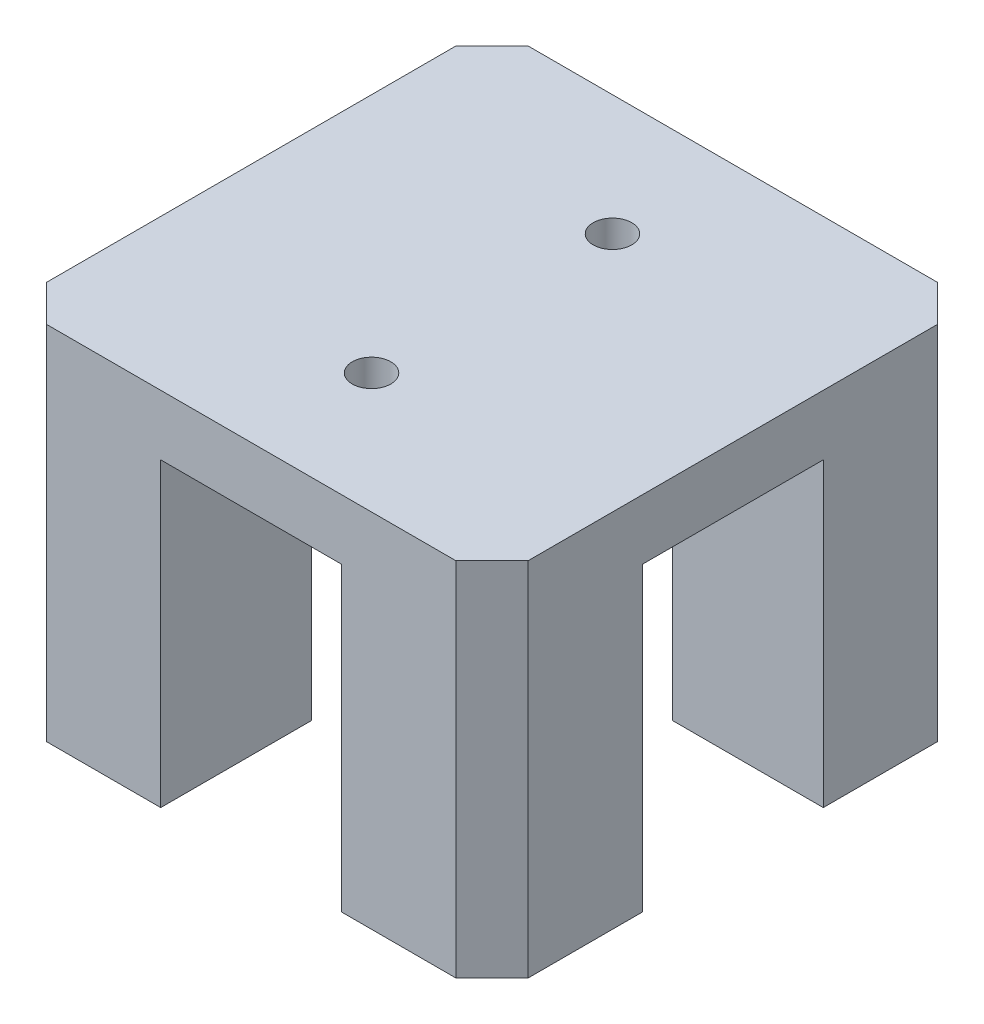
ISO-10303-21;
HEADER;
FILE_DESCRIPTION(('STEP AP214'),'2;1');
FILE_NAME('part.step','',(''),(''),'','','');
FILE_SCHEMA(('AUTOMOTIVE_DESIGN { 1 0 10303 214 1 1 1 1 }'));
ENDSEC;
DATA;
#1=APPLICATION_CONTEXT('core data for automotive mechanical design processes');
#2=APPLICATION_PROTOCOL_DEFINITION('international standard','automotive_design',2000,#1);
#3=PRODUCT_CONTEXT('',#1,'mechanical');
#4=PRODUCT('Part','Part','',(#3));
#5=PRODUCT_RELATED_PRODUCT_CATEGORY('part','',(#4));
#6=PRODUCT_DEFINITION_FORMATION('','',#4);
#7=PRODUCT_DEFINITION_CONTEXT('part definition',#1,'design');
#8=PRODUCT_DEFINITION('design','',#6,#7);
#9=PRODUCT_DEFINITION_SHAPE('','',#8);
#10=(LENGTH_UNIT() NAMED_UNIT(*) SI_UNIT(.MILLI.,.METRE.));
#11=(NAMED_UNIT(*) PLANE_ANGLE_UNIT() SI_UNIT($,.RADIAN.));
#12=(NAMED_UNIT(*) SI_UNIT($,.STERADIAN.) SOLID_ANGLE_UNIT());
#13=UNCERTAINTY_MEASURE_WITH_UNIT(LENGTH_MEASURE(1.E-05),#10,'distance_accuracy_value','');
#14=(GEOMETRIC_REPRESENTATION_CONTEXT(3) GLOBAL_UNCERTAINTY_ASSIGNED_CONTEXT((#13)) GLOBAL_UNIT_ASSIGNED_CONTEXT((#10,
#11,#12)) REPRESENTATION_CONTEXT('',''));
#15=CARTESIAN_POINT('',(0.,0.,0.));
#16=DIRECTION('',(0.,0.,1.));
#17=DIRECTION('',(1.,0.,0.));
#18=AXIS2_PLACEMENT_3D('',#15,#16,#17);
#19=CARTESIAN_POINT('',(0.,0.,0.));
#20=DIRECTION('',(0.,1.,0.));
#21=DIRECTION('',(0.,0.,1.));
#22=AXIS2_PLACEMENT_3D('',#19,#20,#21);
#23=PLANE('',#22);
#24=DIRECTION('',(0.,0.,-1.));
#25=VECTOR('',#24,1.);
#26=CARTESIAN_POINT('',(-7.5,0.,-7.5));
#27=LINE('',#26,#25);
#28=CARTESIAN_POINT('',(-7.5,0.,-7.5));
#29=VERTEX_POINT('',#28);
#30=CARTESIAN_POINT('',(-7.49999999999999,0.,-20.));
#31=VERTEX_POINT('',#30);
#32=EDGE_CURVE('E403',#29,#31,#27,.T.);
#33=ORIENTED_EDGE('',*,*,#32,.F.);
#34=DIRECTION('',(1.,0.,0.));
#35=VECTOR('',#34,1.);
#36=CARTESIAN_POINT('',(-20.,0.,-7.5));
#37=LINE('',#36,#35);
#38=CARTESIAN_POINT('',(-20.,0.,-7.5));
#39=VERTEX_POINT('',#38);
#40=EDGE_CURVE('E200',#39,#29,#37,.T.);
#41=ORIENTED_EDGE('',*,*,#40,.F.);
#42=DIRECTION('',(0.,0.,1.));
#43=VECTOR('',#42,1.);
#44=CARTESIAN_POINT('',(-20.,0.,-20.));
#45=LINE('',#44,#43);
#46=CARTESIAN_POINT('',(-20.,0.,-17.));
#47=VERTEX_POINT('',#46);
#48=EDGE_CURVE('E306',#47,#39,#45,.T.);
#49=ORIENTED_EDGE('',*,*,#48,.F.);
#50=DIRECTION('',(-0.707106781186549,0.,0.707106781186546));
#51=VECTOR('',#50,1.);
#52=CARTESIAN_POINT('',(-20.,0.,-17.));
#53=LINE('',#52,#51);
#54=CARTESIAN_POINT('',(-17.,0.,-20.));
#55=VERTEX_POINT('',#54);
#56=EDGE_CURVE('E342',#47,#55,#53,.F.);
#57=ORIENTED_EDGE('',*,*,#56,.T.);
#58=DIRECTION('',(-1.,0.,0.));
#59=VECTOR('',#58,1.);
#60=CARTESIAN_POINT('',(-20.,0.,-20.));
#61=LINE('',#60,#59);
#62=EDGE_CURVE('E320',#31,#55,#61,.T.);
#63=ORIENTED_EDGE('',*,*,#62,.F.);
#64=EDGE_LOOP('',(#33,#41,#49,#57,#63));
#65=FACE_BOUND('',#64,.T.);
#66=ADVANCED_FACE('F43',(#65),#23,.F.);
#67=DIRECTION('',(1.,0.,0.));
#68=VECTOR('',#67,1.);
#69=CARTESIAN_POINT('',(7.5,0.,-7.5));
#70=LINE('',#69,#68);
#71=CARTESIAN_POINT('',(7.5,0.,-7.5));
#72=VERTEX_POINT('',#71);
#73=CARTESIAN_POINT('',(20.,0.,-7.5));
#74=VERTEX_POINT('',#73);
#75=EDGE_CURVE('E397',#72,#74,#70,.T.);
#76=ORIENTED_EDGE('',*,*,#75,.F.);
#77=DIRECTION('',(0.,0.,1.));
#78=VECTOR('',#77,1.);
#79=CARTESIAN_POINT('',(7.5,0.,-7.5));
#80=LINE('',#79,#78);
#81=CARTESIAN_POINT('',(7.49999999999999,0.,-20.));
#82=VERTEX_POINT('',#81);
#83=EDGE_CURVE('E400',#82,#72,#80,.T.);
#84=ORIENTED_EDGE('',*,*,#83,.F.);
#85=CARTESIAN_POINT('',(17.,0.,-20.));
#86=VERTEX_POINT('',#85);
#87=EDGE_CURVE('E294',#86,#82,#61,.T.);
#88=ORIENTED_EDGE('',*,*,#87,.F.);
#89=DIRECTION('',(-0.707106781186546,0.,-0.707106781186549));
#90=VECTOR('',#89,1.);
#91=CARTESIAN_POINT('',(17.,0.,-20.));
#92=LINE('',#91,#90);
#93=CARTESIAN_POINT('',(20.,0.,-17.));
#94=VERTEX_POINT('',#93);
#95=EDGE_CURVE('E338',#86,#94,#92,.F.);
#96=ORIENTED_EDGE('',*,*,#95,.T.);
#97=DIRECTION('',(0.,0.,-1.));
#98=VECTOR('',#97,1.);
#99=CARTESIAN_POINT('',(20.,0.,-20.));
#100=LINE('',#99,#98);
#101=EDGE_CURVE('E315',#74,#94,#100,.T.);
#102=ORIENTED_EDGE('',*,*,#101,.F.);
#103=EDGE_LOOP('',(#76,#84,#88,#96,#102));
#104=FACE_BOUND('',#103,.T.);
#105=ADVANCED_FACE('F478',(#104),#23,.F.);
#106=DIRECTION('',(0.,0.,1.));
#107=VECTOR('',#106,1.);
#108=CARTESIAN_POINT('',(7.5,0.,20.));
#109=LINE('',#108,#107);
#110=CARTESIAN_POINT('',(7.5,0.,7.5));
#111=VERTEX_POINT('',#110);
#112=CARTESIAN_POINT('',(7.5,0.,20.));
#113=VERTEX_POINT('',#112);
#114=EDGE_CURVE('E387',#111,#113,#109,.T.);
#115=ORIENTED_EDGE('',*,*,#114,.F.);
#116=DIRECTION('',(-1.,0.,0.));
#117=VECTOR('',#116,1.);
#118=CARTESIAN_POINT('',(7.5,0.,7.5));
#119=LINE('',#118,#117);
#120=CARTESIAN_POINT('',(20.,0.,7.5));
#121=VERTEX_POINT('',#120);
#122=EDGE_CURVE('E390',#121,#111,#119,.T.);
#123=ORIENTED_EDGE('',*,*,#122,.F.);
#124=CARTESIAN_POINT('',(20.,0.,17.));
#125=VERTEX_POINT('',#124);
#126=EDGE_CURVE('E316',#125,#121,#100,.T.);
#127=ORIENTED_EDGE('',*,*,#126,.F.);
#128=DIRECTION('',(0.707106781186549,0.,-0.707106781186546));
#129=VECTOR('',#128,1.);
#130=CARTESIAN_POINT('',(20.,0.,17.));
#131=LINE('',#130,#129);
#132=CARTESIAN_POINT('',(17.,0.,20.));
#133=VERTEX_POINT('',#132);
#134=EDGE_CURVE('E334',#125,#133,#131,.F.);
#135=ORIENTED_EDGE('',*,*,#134,.T.);
#136=DIRECTION('',(1.,0.,0.));
#137=VECTOR('',#136,1.);
#138=CARTESIAN_POINT('',(-20.,0.,20.));
#139=LINE('',#138,#137);
#140=EDGE_CURVE('E310',#113,#133,#139,.T.);
#141=ORIENTED_EDGE('',*,*,#140,.F.);
#142=EDGE_LOOP('',(#115,#123,#127,#135,#141));
#143=FACE_BOUND('',#142,.T.);
#144=ADVANCED_FACE('F461',(#143),#23,.F.);
#145=CARTESIAN_POINT('',(-20.,30.,-20.));
#146=DIRECTION('',(1.,0.,0.));
#147=DIRECTION('',(0.,0.,-1.));
#148=AXIS2_PLACEMENT_3D('',#145,#146,#147);
#149=PLANE('',#148);
#150=ORIENTED_EDGE('',*,*,#48,.T.);
#151=DIRECTION('',(0.,-1.,0.));
#152=VECTOR('',#151,1.);
#153=CARTESIAN_POINT('',(-20.,86.5685424949238,-7.5));
#154=LINE('',#153,#152);
#155=CARTESIAN_POINT('',(-20.,25.,-7.5));
#156=VERTEX_POINT('',#155);
#157=EDGE_CURVE('E219',#156,#39,#154,.T.);
#158=ORIENTED_EDGE('',*,*,#157,.F.);
#159=DIRECTION('',(0.,0.,-1.));
#160=VECTOR('',#159,1.);
#161=CARTESIAN_POINT('',(-20.,25.,7.5));
#162=LINE('',#161,#160);
#163=CARTESIAN_POINT('',(-20.,25.,7.5));
#164=VERTEX_POINT('',#163);
#165=EDGE_CURVE('E207',#164,#156,#162,.T.);
#166=ORIENTED_EDGE('',*,*,#165,.F.);
#167=DIRECTION('',(0.,-1.,0.));
#168=VECTOR('',#167,1.);
#169=CARTESIAN_POINT('',(-20.,86.5685424949238,7.5));
#170=LINE('',#169,#168);
#171=CARTESIAN_POINT('',(-20.,0.,7.5));
#172=VERTEX_POINT('',#171);
#173=EDGE_CURVE('E220',#164,#172,#170,.T.);
#174=ORIENTED_EDGE('',*,*,#173,.T.);
#175=CARTESIAN_POINT('',(-20.,0.,17.));
#176=VERTEX_POINT('',#175);
#177=EDGE_CURVE('E288',#172,#176,#45,.T.);
#178=ORIENTED_EDGE('',*,*,#177,.T.);
#179=DIRECTION('',(0.,1.,0.));
#180=VECTOR('',#179,1.);
#181=CARTESIAN_POINT('',(-20.,30.,17.));
#182=LINE('',#181,#180);
#183=CARTESIAN_POINT('',(-20.,30.,17.));
#184=VERTEX_POINT('',#183);
#185=EDGE_CURVE('E305',#176,#184,#182,.T.);
#186=ORIENTED_EDGE('',*,*,#185,.T.);
#187=DIRECTION('',(0.,0.,1.));
#188=VECTOR('',#187,1.);
#189=CARTESIAN_POINT('',(-20.,30.,-20.));
#190=LINE('',#189,#188);
#191=CARTESIAN_POINT('',(-20.,30.,-17.));
#192=VERTEX_POINT('',#191);
#193=EDGE_CURVE('E289',#192,#184,#190,.T.);
#194=ORIENTED_EDGE('',*,*,#193,.F.);
#195=DIRECTION('',(0.,-1.,0.));
#196=VECTOR('',#195,1.);
#197=CARTESIAN_POINT('',(-20.,30.,-17.));
#198=LINE('',#197,#196);
#199=EDGE_CURVE('E326',#192,#47,#198,.T.);
#200=ORIENTED_EDGE('',*,*,#199,.T.);
#201=EDGE_LOOP('',(#150,#158,#166,#174,#178,#186,#194,#200));
#202=FACE_BOUND('',#201,.T.);
#203=ADVANCED_FACE('F447',(#202),#149,.F.);
#204=CARTESIAN_POINT('',(-20.,30.,20.));
#205=DIRECTION('',(0.,0.,-1.));
#206=DIRECTION('',(-1.,0.,0.));
#207=AXIS2_PLACEMENT_3D('',#204,#205,#206);
#208=PLANE('',#207);
#209=DIRECTION('',(-1.,0.,0.));
#210=VECTOR('',#209,1.);
#211=CARTESIAN_POINT('',(-7.5,25.,20.));
#212=LINE('',#211,#210);
#213=CARTESIAN_POINT('',(7.5,25.,20.));
#214=VERTEX_POINT('',#213);
#215=CARTESIAN_POINT('',(-7.5,25.,20.));
#216=VERTEX_POINT('',#215);
#217=EDGE_CURVE('E230',#214,#216,#212,.T.);
#218=ORIENTED_EDGE('',*,*,#217,.F.);
#219=DIRECTION('',(0.,-1.,0.));
#220=VECTOR('',#219,1.);
#221=CARTESIAN_POINT('',(7.5,86.5685424949238,20.));
#222=LINE('',#221,#220);
#223=EDGE_CURVE('E234',#214,#113,#222,.T.);
#224=ORIENTED_EDGE('',*,*,#223,.T.);
#225=ORIENTED_EDGE('',*,*,#140,.T.);
#226=DIRECTION('',(0.,1.,0.));
#227=VECTOR('',#226,1.);
#228=CARTESIAN_POINT('',(17.,30.,20.));
#229=LINE('',#228,#227);
#230=CARTESIAN_POINT('',(17.,30.,20.));
#231=VERTEX_POINT('',#230);
#232=EDGE_CURVE('E12',#133,#231,#229,.T.);
#233=ORIENTED_EDGE('',*,*,#232,.T.);
#234=DIRECTION('',(1.,0.,0.));
#235=VECTOR('',#234,1.);
#236=CARTESIAN_POINT('',(-20.,30.,20.));
#237=LINE('',#236,#235);
#238=CARTESIAN_POINT('',(-17.,30.,20.));
#239=VERTEX_POINT('',#238);
#240=EDGE_CURVE('E293',#239,#231,#237,.T.);
#241=ORIENTED_EDGE('',*,*,#240,.F.);
#242=DIRECTION('',(0.,-1.,0.));
#243=VECTOR('',#242,1.);
#244=CARTESIAN_POINT('',(-17.,30.,20.));
#245=LINE('',#244,#243);
#246=CARTESIAN_POINT('',(-17.,0.,20.));
#247=VERTEX_POINT('',#246);
#248=EDGE_CURVE('E53',#239,#247,#245,.T.);
#249=ORIENTED_EDGE('',*,*,#248,.T.);
#250=CARTESIAN_POINT('',(-7.5,0.,20.));
#251=VERTEX_POINT('',#250);
#252=EDGE_CURVE('E311',#247,#251,#139,.T.);
#253=ORIENTED_EDGE('',*,*,#252,.T.);
#254=DIRECTION('',(0.,-1.,0.));
#255=VECTOR('',#254,1.);
#256=CARTESIAN_POINT('',(-7.5,86.5685424949238,20.));
#257=LINE('',#256,#255);
#258=EDGE_CURVE('E229',#216,#251,#257,.T.);
#259=ORIENTED_EDGE('',*,*,#258,.F.);
#260=EDGE_LOOP('',(#218,#224,#225,#233,#241,#249,#253,#259));
#261=FACE_BOUND('',#260,.T.);
#262=ADVANCED_FACE('F377',(#261),#208,.F.);
#263=CARTESIAN_POINT('',(20.,30.,-20.));
#264=DIRECTION('',(-1.,0.,0.));
#265=DIRECTION('',(0.,0.,1.));
#266=AXIS2_PLACEMENT_3D('',#263,#264,#265);
#267=PLANE('',#266);
#268=DIRECTION('',(0.,0.,1.));
#269=VECTOR('',#268,1.);
#270=CARTESIAN_POINT('',(20.,25.,7.5));
#271=LINE('',#270,#269);
#272=CARTESIAN_POINT('',(20.,25.,-7.5));
#273=VERTEX_POINT('',#272);
#274=CARTESIAN_POINT('',(20.,25.,7.5));
#275=VERTEX_POINT('',#274);
#276=EDGE_CURVE('E245',#273,#275,#271,.T.);
#277=ORIENTED_EDGE('',*,*,#276,.F.);
#278=DIRECTION('',(0.,-1.,0.));
#279=VECTOR('',#278,1.);
#280=CARTESIAN_POINT('',(20.,86.5685424949238,-7.5));
#281=LINE('',#280,#279);
#282=EDGE_CURVE('E249',#273,#74,#281,.T.);
#283=ORIENTED_EDGE('',*,*,#282,.T.);
#284=ORIENTED_EDGE('',*,*,#101,.T.);
#285=DIRECTION('',(0.,1.,0.));
#286=VECTOR('',#285,1.);
#287=CARTESIAN_POINT('',(20.,30.,-17.));
#288=LINE('',#287,#286);
#289=CARTESIAN_POINT('',(20.,30.,-17.));
#290=VERTEX_POINT('',#289);
#291=EDGE_CURVE('E68',#94,#290,#288,.T.);
#292=ORIENTED_EDGE('',*,*,#291,.T.);
#293=DIRECTION('',(0.,0.,-1.));
#294=VECTOR('',#293,1.);
#295=CARTESIAN_POINT('',(20.,30.,-20.));
#296=LINE('',#295,#294);
#297=CARTESIAN_POINT('',(20.,30.,17.));
#298=VERTEX_POINT('',#297);
#299=EDGE_CURVE('E298',#298,#290,#296,.T.);
#300=ORIENTED_EDGE('',*,*,#299,.F.);
#301=DIRECTION('',(0.,-1.,0.));
#302=VECTOR('',#301,1.);
#303=CARTESIAN_POINT('',(20.,30.,17.));
#304=LINE('',#303,#302);
#305=EDGE_CURVE('E365',#298,#125,#304,.T.);
#306=ORIENTED_EDGE('',*,*,#305,.T.);
#307=ORIENTED_EDGE('',*,*,#126,.T.);
#308=DIRECTION('',(0.,-1.,0.));
#309=VECTOR('',#308,1.);
#310=CARTESIAN_POINT('',(20.,86.5685424949238,7.5));
#311=LINE('',#310,#309);
#312=EDGE_CURVE('E244',#275,#121,#311,.T.);
#313=ORIENTED_EDGE('',*,*,#312,.F.);
#314=EDGE_LOOP('',(#277,#283,#284,#292,#300,#306,#307,#313));
#315=FACE_BOUND('',#314,.T.);
#316=ADVANCED_FACE('F498',(#315),#267,.F.);
#317=CARTESIAN_POINT('',(-20.,30.,-20.));
#318=DIRECTION('',(0.,0.,1.));
#319=DIRECTION('',(1.,0.,0.));
#320=AXIS2_PLACEMENT_3D('',#317,#318,#319);
#321=PLANE('',#320);
#322=DIRECTION('',(1.,0.,0.));
#323=VECTOR('',#322,1.);
#324=CARTESIAN_POINT('',(-7.49999999999999,25.,-20.));
#325=LINE('',#324,#323);
#326=CARTESIAN_POINT('',(-7.49999999999999,25.,-20.));
#327=VERTEX_POINT('',#326);
#328=CARTESIAN_POINT('',(7.49999999999999,25.,-20.));
#329=VERTEX_POINT('',#328);
#330=EDGE_CURVE('E260',#327,#329,#325,.T.);
#331=ORIENTED_EDGE('',*,*,#330,.F.);
#332=DIRECTION('',(0.,-1.,0.));
#333=VECTOR('',#332,1.);
#334=CARTESIAN_POINT('',(-7.49999999999999,86.5685424949238,-20.));
#335=LINE('',#334,#333);
#336=EDGE_CURVE('E188',#327,#31,#335,.T.);
#337=ORIENTED_EDGE('',*,*,#336,.T.);
#338=ORIENTED_EDGE('',*,*,#62,.T.);
#339=DIRECTION('',(0.,1.,0.));
#340=VECTOR('',#339,1.);
#341=CARTESIAN_POINT('',(-17.,30.,-20.));
#342=LINE('',#341,#340);
#343=CARTESIAN_POINT('',(-17.,30.,-20.));
#344=VERTEX_POINT('',#343);
#345=EDGE_CURVE('E350',#55,#344,#342,.T.);
#346=ORIENTED_EDGE('',*,*,#345,.T.);
#347=DIRECTION('',(-1.,0.,0.));
#348=VECTOR('',#347,1.);
#349=CARTESIAN_POINT('',(-20.,30.,-20.));
#350=LINE('',#349,#348);
#351=CARTESIAN_POINT('',(17.,30.,-20.));
#352=VERTEX_POINT('',#351);
#353=EDGE_CURVE('E301',#352,#344,#350,.T.);
#354=ORIENTED_EDGE('',*,*,#353,.F.);
#355=DIRECTION('',(0.,-1.,0.));
#356=VECTOR('',#355,1.);
#357=CARTESIAN_POINT('',(17.,30.,-20.));
#358=LINE('',#357,#356);
#359=EDGE_CURVE('E346',#352,#86,#358,.T.);
#360=ORIENTED_EDGE('',*,*,#359,.T.);
#361=ORIENTED_EDGE('',*,*,#87,.T.);
#362=DIRECTION('',(0.,-1.,0.));
#363=VECTOR('',#362,1.);
#364=CARTESIAN_POINT('',(7.49999999999999,86.5685424949238,-20.));
#365=LINE('',#364,#363);
#366=EDGE_CURVE('E259',#329,#82,#365,.T.);
#367=ORIENTED_EDGE('',*,*,#366,.F.);
#368=EDGE_LOOP('',(#331,#337,#338,#346,#354,#360,#361,#367));
#369=FACE_BOUND('',#368,.T.);
#370=ADVANCED_FACE('F431',(#369),#321,.F.);
#371=CARTESIAN_POINT('',(0.,30.,0.));
#372=DIRECTION('',(0.,1.,0.));
#373=DIRECTION('',(0.,0.,1.));
#374=AXIS2_PLACEMENT_3D('',#371,#372,#373);
#375=PLANE('',#374);
#376=CARTESIAN_POINT('',(0.,30.,-10.));
#377=DIRECTION('',(0.,1.,0.));
#378=DIRECTION('',(0.,0.,1.));
#379=AXIS2_PLACEMENT_3D('',#376,#377,#378);
#380=CIRCLE('',#379,1.6);
#381=CARTESIAN_POINT('',(0.,30.,-8.4));
#382=VERTEX_POINT('',#381);
#383=EDGE_CURVE('E420',#382,#382,#380,.T.);
#384=ORIENTED_EDGE('',*,*,#383,.F.);
#385=EDGE_LOOP('',(#384));
#386=FACE_BOUND('',#385,.T.);
#387=CARTESIAN_POINT('',(0.,30.,10.));
#388=DIRECTION('',(0.,1.,0.));
#389=DIRECTION('',(0.,0.,1.));
#390=AXIS2_PLACEMENT_3D('',#387,#388,#389);
#391=CIRCLE('',#390,1.6);
#392=CARTESIAN_POINT('',(0.,30.,11.6));
#393=VERTEX_POINT('',#392);
#394=EDGE_CURVE('E409',#393,#393,#391,.T.);
#395=ORIENTED_EDGE('',*,*,#394,.F.);
#396=EDGE_LOOP('',(#395));
#397=FACE_BOUND('',#396,.T.);
#398=ORIENTED_EDGE('',*,*,#353,.T.);
#399=DIRECTION('',(0.707106781186549,0.,-0.707106781186546));
#400=VECTOR('',#399,1.);
#401=CARTESIAN_POINT('',(-18.5,30.,-18.5));
#402=LINE('',#401,#400);
#403=EDGE_CURVE('E362',#344,#192,#402,.F.);
#404=ORIENTED_EDGE('',*,*,#403,.T.);
#405=ORIENTED_EDGE('',*,*,#193,.T.);
#406=DIRECTION('',(-0.707106781186546,0.,-0.707106781186549));
#407=VECTOR('',#406,1.);
#408=CARTESIAN_POINT('',(-18.5,30.,18.5));
#409=LINE('',#408,#407);
#410=EDGE_CURVE('E353',#184,#239,#409,.F.);
#411=ORIENTED_EDGE('',*,*,#410,.T.);
#412=ORIENTED_EDGE('',*,*,#240,.T.);
#413=DIRECTION('',(-0.707106781186549,0.,0.707106781186546));
#414=VECTOR('',#413,1.);
#415=CARTESIAN_POINT('',(18.5,30.,18.5));
#416=LINE('',#415,#414);
#417=EDGE_CURVE('E356',#231,#298,#416,.F.);
#418=ORIENTED_EDGE('',*,*,#417,.T.);
#419=ORIENTED_EDGE('',*,*,#299,.T.);
#420=DIRECTION('',(0.707106781186546,0.,0.707106781186549));
#421=VECTOR('',#420,1.);
#422=CARTESIAN_POINT('',(18.5,30.,-18.5));
#423=LINE('',#422,#421);
#424=EDGE_CURVE('E359',#290,#352,#423,.F.);
#425=ORIENTED_EDGE('',*,*,#424,.T.);
#426=EDGE_LOOP('',(#398,#404,#405,#411,#412,#418,#419,#425));
#427=FACE_BOUND('',#426,.T.);
#428=ADVANCED_FACE('F428',(#386,#397,#427),#375,.T.);
#429=DIRECTION('',(-1.,0.,0.));
#430=VECTOR('',#429,1.);
#431=CARTESIAN_POINT('',(-20.,0.,7.5));
#432=LINE('',#431,#430);
#433=CARTESIAN_POINT('',(-7.5,0.,7.5));
#434=VERTEX_POINT('',#433);
#435=EDGE_CURVE('E210',#434,#172,#432,.T.);
#436=ORIENTED_EDGE('',*,*,#435,.F.);
#437=DIRECTION('',(0.,0.,-1.));
#438=VECTOR('',#437,1.);
#439=CARTESIAN_POINT('',(-7.5,0.,20.));
#440=LINE('',#439,#438);
#441=EDGE_CURVE('E60',#251,#434,#440,.T.);
#442=ORIENTED_EDGE('',*,*,#441,.F.);
#443=ORIENTED_EDGE('',*,*,#252,.F.);
#444=DIRECTION('',(0.707106781186546,0.,0.707106781186549));
#445=VECTOR('',#444,1.);
#446=CARTESIAN_POINT('',(-17.,0.,20.));
#447=LINE('',#446,#445);
#448=EDGE_CURVE('E330',#247,#176,#447,.F.);
#449=ORIENTED_EDGE('',*,*,#448,.T.);
#450=ORIENTED_EDGE('',*,*,#177,.F.);
#451=EDGE_LOOP('',(#436,#442,#443,#449,#450));
#452=FACE_BOUND('',#451,.T.);
#453=ADVANCED_FACE('F383',(#452),#23,.F.);
#454=CARTESIAN_POINT('',(-20.,30.,-17.));
#455=DIRECTION('',(0.707106781186546,0.,0.707106781186549));
#456=DIRECTION('',(0.,-1.,0.));
#457=AXIS2_PLACEMENT_3D('',#454,#455,#456);
#458=PLANE('',#457);
#459=ORIENTED_EDGE('',*,*,#403,.F.);
#460=ORIENTED_EDGE('',*,*,#345,.F.);
#461=ORIENTED_EDGE('',*,*,#56,.F.);
#462=ORIENTED_EDGE('',*,*,#199,.F.);
#463=EDGE_LOOP('',(#459,#460,#461,#462));
#464=FACE_BOUND('',#463,.T.);
#465=ADVANCED_FACE('F444',(#464),#458,.F.);
#466=CARTESIAN_POINT('',(17.,30.,-20.));
#467=DIRECTION('',(-0.707106781186549,0.,0.707106781186546));
#468=DIRECTION('',(0.,-1.,0.));
#469=AXIS2_PLACEMENT_3D('',#466,#467,#468);
#470=PLANE('',#469);
#471=ORIENTED_EDGE('',*,*,#424,.F.);
#472=ORIENTED_EDGE('',*,*,#291,.F.);
#473=ORIENTED_EDGE('',*,*,#95,.F.);
#474=ORIENTED_EDGE('',*,*,#359,.F.);
#475=EDGE_LOOP('',(#471,#472,#473,#474));
#476=FACE_BOUND('',#475,.T.);
#477=ADVANCED_FACE('F476',(#476),#470,.F.);
#478=CARTESIAN_POINT('',(20.,30.,17.));
#479=DIRECTION('',(-0.707106781186546,0.,-0.707106781186549));
#480=DIRECTION('',(0.,-1.,0.));
#481=AXIS2_PLACEMENT_3D('',#478,#479,#480);
#482=PLANE('',#481);
#483=ORIENTED_EDGE('',*,*,#417,.F.);
#484=ORIENTED_EDGE('',*,*,#232,.F.);
#485=ORIENTED_EDGE('',*,*,#134,.F.);
#486=ORIENTED_EDGE('',*,*,#305,.F.);
#487=EDGE_LOOP('',(#483,#484,#485,#486));
#488=FACE_BOUND('',#487,.T.);
#489=ADVANCED_FACE('F468',(#488),#482,.F.);
#490=CARTESIAN_POINT('',(-17.,30.,20.));
#491=DIRECTION('',(0.707106781186549,0.,-0.707106781186546));
#492=DIRECTION('',(0.,-1.,0.));
#493=AXIS2_PLACEMENT_3D('',#490,#491,#492);
#494=PLANE('',#493);
#495=ORIENTED_EDGE('',*,*,#410,.F.);
#496=ORIENTED_EDGE('',*,*,#185,.F.);
#497=ORIENTED_EDGE('',*,*,#448,.F.);
#498=ORIENTED_EDGE('',*,*,#248,.F.);
#499=EDGE_LOOP('',(#495,#496,#497,#498));
#500=FACE_BOUND('',#499,.T.);
#501=ADVANCED_FACE('F46',(#500),#494,.F.);
#502=CARTESIAN_POINT('',(0.,25.,0.));
#503=DIRECTION('',(0.,1.,0.));
#504=DIRECTION('',(0.,0.,1.));
#505=AXIS2_PLACEMENT_3D('',#502,#503,#504);
#506=PLANE('',#505);
#507=CARTESIAN_POINT('',(0.,25.,-10.));
#508=DIRECTION('',(0.,1.,0.));
#509=DIRECTION('',(0.,0.,1.));
#510=AXIS2_PLACEMENT_3D('',#507,#508,#509);
#511=CIRCLE('',#510,1.6);
#512=CARTESIAN_POINT('',(0.,25.,-8.4));
#513=VERTEX_POINT('',#512);
#514=EDGE_CURVE('E414',#513,#513,#511,.T.);
#515=ORIENTED_EDGE('',*,*,#514,.T.);
#516=EDGE_LOOP('',(#515));
#517=FACE_BOUND('',#516,.T.);
#518=CARTESIAN_POINT('',(0.,25.,10.));
#519=DIRECTION('',(0.,1.,0.));
#520=DIRECTION('',(0.,0.,1.));
#521=AXIS2_PLACEMENT_3D('',#518,#519,#520);
#522=CIRCLE('',#521,1.6);
#523=CARTESIAN_POINT('',(0.,25.,11.6));
#524=VERTEX_POINT('',#523);
#525=EDGE_CURVE('E406',#524,#524,#522,.T.);
#526=ORIENTED_EDGE('',*,*,#525,.T.);
#527=EDGE_LOOP('',(#526));
#528=FACE_BOUND('',#527,.T.);
#529=ORIENTED_EDGE('',*,*,#165,.T.);
#530=DIRECTION('',(1.,0.,0.));
#531=VECTOR('',#530,1.);
#532=CARTESIAN_POINT('',(-20.,25.,-7.5));
#533=LINE('',#532,#531);
#534=CARTESIAN_POINT('',(-7.5,25.,-7.5));
#535=VERTEX_POINT('',#534);
#536=EDGE_CURVE('E197',#156,#535,#533,.T.);
#537=ORIENTED_EDGE('',*,*,#536,.T.);
#538=DIRECTION('',(0.,0.,-1.));
#539=VECTOR('',#538,1.);
#540=CARTESIAN_POINT('',(-7.5,25.,-7.5));
#541=LINE('',#540,#539);
#542=EDGE_CURVE('E182',#535,#327,#541,.T.);
#543=ORIENTED_EDGE('',*,*,#542,.T.);
#544=ORIENTED_EDGE('',*,*,#330,.T.);
#545=DIRECTION('',(0.,0.,1.));
#546=VECTOR('',#545,1.);
#547=CARTESIAN_POINT('',(7.5,25.,-7.5));
#548=LINE('',#547,#546);
#549=CARTESIAN_POINT('',(7.5,25.,-7.5));
#550=VERTEX_POINT('',#549);
#551=EDGE_CURVE('E255',#329,#550,#548,.T.);
#552=ORIENTED_EDGE('',*,*,#551,.T.);
#553=DIRECTION('',(1.,0.,0.));
#554=VECTOR('',#553,1.);
#555=CARTESIAN_POINT('',(7.5,25.,-7.5));
#556=LINE('',#555,#554);
#557=EDGE_CURVE('E250',#550,#273,#556,.T.);
#558=ORIENTED_EDGE('',*,*,#557,.T.);
#559=ORIENTED_EDGE('',*,*,#276,.T.);
#560=DIRECTION('',(-1.,0.,0.));
#561=VECTOR('',#560,1.);
#562=CARTESIAN_POINT('',(7.5,25.,7.5));
#563=LINE('',#562,#561);
#564=CARTESIAN_POINT('',(7.5,25.,7.5));
#565=VERTEX_POINT('',#564);
#566=EDGE_CURVE('E240',#275,#565,#563,.T.);
#567=ORIENTED_EDGE('',*,*,#566,.T.);
#568=DIRECTION('',(0.,0.,1.));
#569=VECTOR('',#568,1.);
#570=CARTESIAN_POINT('',(7.5,25.,20.));
#571=LINE('',#570,#569);
#572=EDGE_CURVE('E235',#565,#214,#571,.T.);
#573=ORIENTED_EDGE('',*,*,#572,.T.);
#574=ORIENTED_EDGE('',*,*,#217,.T.);
#575=DIRECTION('',(0.,0.,-1.));
#576=VECTOR('',#575,1.);
#577=CARTESIAN_POINT('',(-7.5,25.,20.));
#578=LINE('',#577,#576);
#579=CARTESIAN_POINT('',(-7.5,25.,7.5));
#580=VERTEX_POINT('',#579);
#581=EDGE_CURVE('E225',#216,#580,#578,.T.);
#582=ORIENTED_EDGE('',*,*,#581,.T.);
#583=DIRECTION('',(-1.,0.,0.));
#584=VECTOR('',#583,1.);
#585=CARTESIAN_POINT('',(-20.,25.,7.5));
#586=LINE('',#585,#584);
#587=EDGE_CURVE('E221',#580,#164,#586,.T.);
#588=ORIENTED_EDGE('',*,*,#587,.T.);
#589=EDGE_LOOP('',(#529,#537,#543,#544,#552,#558,#559,#567,#573,#574,#582,#588));
#590=FACE_BOUND('',#589,.T.);
#591=ADVANCED_FACE('F204',(#517,#528,#590),#506,.F.);
#592=CARTESIAN_POINT('',(-20.,86.5685424949238,-7.5));
#593=DIRECTION('',(0.,0.,-1.));
#594=DIRECTION('',(-1.,0.,0.));
#595=AXIS2_PLACEMENT_3D('',#592,#593,#594);
#596=PLANE('',#595);
#597=ORIENTED_EDGE('',*,*,#157,.T.);
#598=ORIENTED_EDGE('',*,*,#40,.T.);
#599=DIRECTION('',(0.,-1.,0.));
#600=VECTOR('',#599,1.);
#601=CARTESIAN_POINT('',(-7.5,86.5685424949238,-7.5));
#602=LINE('',#601,#600);
#603=EDGE_CURVE('E185',#535,#29,#602,.T.);
#604=ORIENTED_EDGE('',*,*,#603,.F.);
#605=ORIENTED_EDGE('',*,*,#536,.F.);
#606=EDGE_LOOP('',(#597,#598,#604,#605));
#607=FACE_BOUND('',#606,.T.);
#608=ADVANCED_FACE('F196',(#607),#596,.F.);
#609=CARTESIAN_POINT('',(-7.5,86.5685424949238,-7.5));
#610=DIRECTION('',(-1.,0.,0.));
#611=DIRECTION('',(0.,0.,1.));
#612=AXIS2_PLACEMENT_3D('',#609,#610,#611);
#613=PLANE('',#612);
#614=ORIENTED_EDGE('',*,*,#603,.T.);
#615=ORIENTED_EDGE('',*,*,#32,.T.);
#616=ORIENTED_EDGE('',*,*,#336,.F.);
#617=ORIENTED_EDGE('',*,*,#542,.F.);
#618=EDGE_LOOP('',(#614,#615,#616,#617));
#619=FACE_BOUND('',#618,.T.);
#620=ADVANCED_FACE('F184',(#619),#613,.F.);
#621=CARTESIAN_POINT('',(7.5,86.5685424949238,-7.5));
#622=DIRECTION('',(1.,0.,0.));
#623=DIRECTION('',(0.,0.,-1.));
#624=AXIS2_PLACEMENT_3D('',#621,#622,#623);
#625=PLANE('',#624);
#626=ORIENTED_EDGE('',*,*,#366,.T.);
#627=ORIENTED_EDGE('',*,*,#83,.T.);
#628=DIRECTION('',(0.,-1.,0.));
#629=VECTOR('',#628,1.);
#630=CARTESIAN_POINT('',(7.5,86.5685424949238,-7.5));
#631=LINE('',#630,#629);
#632=EDGE_CURVE('E254',#550,#72,#631,.T.);
#633=ORIENTED_EDGE('',*,*,#632,.F.);
#634=ORIENTED_EDGE('',*,*,#551,.F.);
#635=EDGE_LOOP('',(#626,#627,#633,#634));
#636=FACE_BOUND('',#635,.T.);
#637=ADVANCED_FACE('F524',(#636),#625,.F.);
#638=CARTESIAN_POINT('',(7.5,86.5685424949238,-7.5));
#639=DIRECTION('',(0.,0.,-1.));
#640=DIRECTION('',(-1.,0.,0.));
#641=AXIS2_PLACEMENT_3D('',#638,#639,#640);
#642=PLANE('',#641);
#643=ORIENTED_EDGE('',*,*,#632,.T.);
#644=ORIENTED_EDGE('',*,*,#75,.T.);
#645=ORIENTED_EDGE('',*,*,#282,.F.);
#646=ORIENTED_EDGE('',*,*,#557,.F.);
#647=EDGE_LOOP('',(#643,#644,#645,#646));
#648=FACE_BOUND('',#647,.T.);
#649=ADVANCED_FACE('F539',(#648),#642,.F.);
#650=CARTESIAN_POINT('',(7.5,86.5685424949238,7.5));
#651=DIRECTION('',(0.,0.,1.));
#652=DIRECTION('',(1.,0.,0.));
#653=AXIS2_PLACEMENT_3D('',#650,#651,#652);
#654=PLANE('',#653);
#655=ORIENTED_EDGE('',*,*,#312,.T.);
#656=ORIENTED_EDGE('',*,*,#122,.T.);
#657=DIRECTION('',(0.,-1.,0.));
#658=VECTOR('',#657,1.);
#659=CARTESIAN_POINT('',(7.5,86.5685424949238,7.5));
#660=LINE('',#659,#658);
#661=EDGE_CURVE('E239',#565,#111,#660,.T.);
#662=ORIENTED_EDGE('',*,*,#661,.F.);
#663=ORIENTED_EDGE('',*,*,#566,.F.);
#664=EDGE_LOOP('',(#655,#656,#662,#663));
#665=FACE_BOUND('',#664,.T.);
#666=ADVANCED_FACE('F529',(#665),#654,.F.);
#667=CARTESIAN_POINT('',(7.5,86.5685424949238,20.));
#668=DIRECTION('',(1.,0.,0.));
#669=DIRECTION('',(0.,0.,-1.));
#670=AXIS2_PLACEMENT_3D('',#667,#668,#669);
#671=PLANE('',#670);
#672=ORIENTED_EDGE('',*,*,#661,.T.);
#673=ORIENTED_EDGE('',*,*,#114,.T.);
#674=ORIENTED_EDGE('',*,*,#223,.F.);
#675=ORIENTED_EDGE('',*,*,#572,.F.);
#676=EDGE_LOOP('',(#672,#673,#674,#675));
#677=FACE_BOUND('',#676,.T.);
#678=ADVANCED_FACE('F531',(#677),#671,.F.);
#679=CARTESIAN_POINT('',(-7.5,86.5685424949238,20.));
#680=DIRECTION('',(-1.,0.,0.));
#681=DIRECTION('',(0.,0.,1.));
#682=AXIS2_PLACEMENT_3D('',#679,#680,#681);
#683=PLANE('',#682);
#684=ORIENTED_EDGE('',*,*,#258,.T.);
#685=ORIENTED_EDGE('',*,*,#441,.T.);
#686=DIRECTION('',(0.,-1.,0.));
#687=VECTOR('',#686,1.);
#688=CARTESIAN_POINT('',(-7.5,86.5685424949238,7.5));
#689=LINE('',#688,#687);
#690=EDGE_CURVE('E224',#580,#434,#689,.T.);
#691=ORIENTED_EDGE('',*,*,#690,.F.);
#692=ORIENTED_EDGE('',*,*,#581,.F.);
#693=EDGE_LOOP('',(#684,#685,#691,#692));
#694=FACE_BOUND('',#693,.T.);
#695=ADVANCED_FACE('F456',(#694),#683,.F.);
#696=CARTESIAN_POINT('',(-20.,86.5685424949238,7.5));
#697=DIRECTION('',(0.,0.,1.));
#698=DIRECTION('',(1.,0.,0.));
#699=AXIS2_PLACEMENT_3D('',#696,#697,#698);
#700=PLANE('',#699);
#701=ORIENTED_EDGE('',*,*,#690,.T.);
#702=ORIENTED_EDGE('',*,*,#435,.T.);
#703=ORIENTED_EDGE('',*,*,#173,.F.);
#704=ORIENTED_EDGE('',*,*,#587,.F.);
#705=EDGE_LOOP('',(#701,#702,#703,#704));
#706=FACE_BOUND('',#705,.T.);
#707=ADVANCED_FACE('F455',(#706),#700,.F.);
#708=CARTESIAN_POINT('',(0.,30.,10.));
#709=DIRECTION('',(0.,1.,0.));
#710=DIRECTION('',(0.,0.,1.));
#711=AXIS2_PLACEMENT_3D('',#708,#709,#710);
#712=CYLINDRICAL_SURFACE('',#711,1.6);
#713=ORIENTED_EDGE('',*,*,#394,.T.);
#714=EDGE_LOOP('',(#713));
#715=FACE_BOUND('',#714,.T.);
#716=ORIENTED_EDGE('',*,*,#525,.F.);
#717=EDGE_LOOP('',(#716));
#718=FACE_BOUND('',#717,.T.);
#719=ADVANCED_FACE('F589',(#715,#718),#712,.F.);
#720=CARTESIAN_POINT('',(0.,30.,-10.));
#721=DIRECTION('',(0.,1.,0.));
#722=DIRECTION('',(0.,0.,1.));
#723=AXIS2_PLACEMENT_3D('',#720,#721,#722);
#724=CYLINDRICAL_SURFACE('',#723,1.6);
#725=ORIENTED_EDGE('',*,*,#383,.T.);
#726=EDGE_LOOP('',(#725));
#727=FACE_BOUND('',#726,.T.);
#728=ORIENTED_EDGE('',*,*,#514,.F.);
#729=EDGE_LOOP('',(#728));
#730=FACE_BOUND('',#729,.T.);
#731=ADVANCED_FACE('F425',(#727,#730),#724,.F.);
#732=CLOSED_SHELL('',(#66,#105,#144,#203,#262,#316,#370,#428,#453,#465,#477,#489,#501,#591,#608,
#620,#637,#649,#666,#678,#695,#707,#719,#731));
#733=MANIFOLD_SOLID_BREP('B2',#732);
#734=ADVANCED_BREP_SHAPE_REPRESENTATION('',(#18,#733),#14);
#735=SHAPE_DEFINITION_REPRESENTATION(#9,#734);
ENDSEC;
END-ISO-10303-21;
